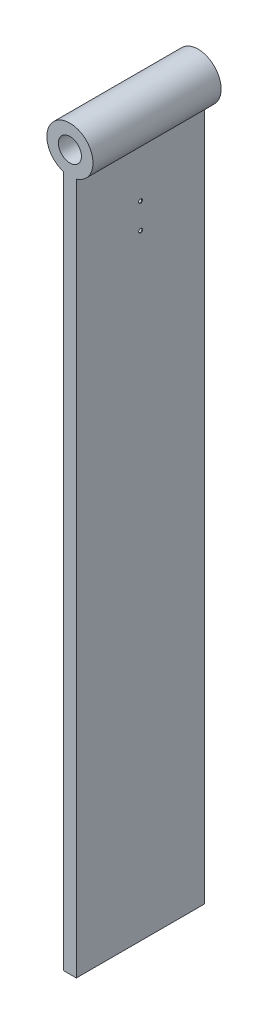
ISO-10303-21;
HEADER;
FILE_DESCRIPTION(('STEP AP214'),'2;1');
FILE_NAME('part.step','',(''),(''),'','','');
FILE_SCHEMA(('AUTOMOTIVE_DESIGN { 1 0 10303 214 1 1 1 1 }'));
ENDSEC;
DATA;
#1=APPLICATION_CONTEXT('core data for automotive mechanical design processes');
#2=APPLICATION_PROTOCOL_DEFINITION('international standard','automotive_design',2000,#1);
#3=PRODUCT_CONTEXT('',#1,'mechanical');
#4=PRODUCT('Part','Part','',(#3));
#5=PRODUCT_RELATED_PRODUCT_CATEGORY('part','',(#4));
#6=PRODUCT_DEFINITION_FORMATION('','',#4);
#7=PRODUCT_DEFINITION_CONTEXT('part definition',#1,'design');
#8=PRODUCT_DEFINITION('design','',#6,#7);
#9=PRODUCT_DEFINITION_SHAPE('','',#8);
#10=(LENGTH_UNIT() NAMED_UNIT(*) SI_UNIT(.MILLI.,.METRE.));
#11=(NAMED_UNIT(*) PLANE_ANGLE_UNIT() SI_UNIT($,.RADIAN.));
#12=(NAMED_UNIT(*) SI_UNIT($,.STERADIAN.) SOLID_ANGLE_UNIT());
#13=UNCERTAINTY_MEASURE_WITH_UNIT(LENGTH_MEASURE(1.E-05),#10,'distance_accuracy_value','');
#14=(GEOMETRIC_REPRESENTATION_CONTEXT(3) GLOBAL_UNCERTAINTY_ASSIGNED_CONTEXT((#13)) GLOBAL_UNIT_ASSIGNED_CONTEXT((#10,
#11,#12)) REPRESENTATION_CONTEXT('',''));
#15=CARTESIAN_POINT('',(0.,0.,0.));
#16=DIRECTION('',(0.,0.,1.));
#17=DIRECTION('',(1.,0.,0.));
#18=AXIS2_PLACEMENT_3D('',#15,#16,#17);
#19=CARTESIAN_POINT('',(0.,0.,100.));
#20=DIRECTION('',(0.,1.,0.));
#21=DIRECTION('',(0.,0.,1.));
#22=AXIS2_PLACEMENT_3D('',#19,#20,#21);
#23=PLANE('',#22);
#24=DIRECTION('',(1.,0.,0.));
#25=VECTOR('',#24,1.);
#26=CARTESIAN_POINT('',(0.,0.,0.));
#27=LINE('',#26,#25);
#28=CARTESIAN_POINT('',(-5.,0.,0.));
#29=VERTEX_POINT('',#28);
#30=CARTESIAN_POINT('',(5.,0.,0.));
#31=VERTEX_POINT('',#30);
#32=EDGE_CURVE('E77',#29,#31,#27,.T.);
#33=ORIENTED_EDGE('',*,*,#32,.T.);
#34=DIRECTION('',(0.,0.,-1.));
#35=VECTOR('',#34,1.);
#36=CARTESIAN_POINT('',(5.,0.,100.));
#37=LINE('',#36,#35);
#38=CARTESIAN_POINT('',(5.,0.,100.));
#39=VERTEX_POINT('',#38);
#40=EDGE_CURVE('E11',#39,#31,#37,.T.);
#41=ORIENTED_EDGE('',*,*,#40,.F.);
#42=DIRECTION('',(1.,0.,0.));
#43=VECTOR('',#42,1.);
#44=CARTESIAN_POINT('',(0.,0.,100.));
#45=LINE('',#44,#43);
#46=CARTESIAN_POINT('',(-5.,0.,100.));
#47=VERTEX_POINT('',#46);
#48=EDGE_CURVE('E82',#47,#39,#45,.T.);
#49=ORIENTED_EDGE('',*,*,#48,.F.);
#50=DIRECTION('',(0.,0.,-1.));
#51=VECTOR('',#50,1.);
#52=CARTESIAN_POINT('',(-5.,0.,100.));
#53=LINE('',#52,#51);
#54=EDGE_CURVE('E98',#47,#29,#53,.T.);
#55=ORIENTED_EDGE('',*,*,#54,.T.);
#56=EDGE_LOOP('',(#33,#41,#49,#55));
#57=FACE_BOUND('',#56,.T.);
#58=ADVANCED_FACE('F35',(#57),#23,.F.);
#59=CARTESIAN_POINT('',(5.,0.,100.));
#60=DIRECTION('',(-1.,0.,0.));
#61=DIRECTION('',(0.,0.,1.));
#62=AXIS2_PLACEMENT_3D('',#59,#60,#61);
#63=PLANE('',#62);
#64=CARTESIAN_POINT('',(5.,480.,49.8902821263165));
#65=DIRECTION('',(1.,0.,0.));
#66=DIRECTION('',(0.,0.,-1.));
#67=AXIS2_PLACEMENT_3D('',#64,#65,#66);
#68=CIRCLE('',#67,1.525);
#69=CARTESIAN_POINT('',(5.,480.,48.3652821263165));
#70=VERTEX_POINT('',#69);
#71=EDGE_CURVE('E163',#70,#70,#68,.T.);
#72=ORIENTED_EDGE('',*,*,#71,.F.);
#73=EDGE_LOOP('',(#72));
#74=FACE_BOUND('',#73,.T.);
#75=CARTESIAN_POINT('',(5.,500.,49.9389055545462));
#76=DIRECTION('',(1.,0.,0.));
#77=DIRECTION('',(0.,0.,-1.));
#78=AXIS2_PLACEMENT_3D('',#75,#76,#77);
#79=CIRCLE('',#78,1.525);
#80=CARTESIAN_POINT('',(5.,500.,48.4139055545462));
#81=VERTEX_POINT('',#80);
#82=EDGE_CURVE('E119',#81,#81,#79,.T.);
#83=ORIENTED_EDGE('',*,*,#82,.F.);
#84=EDGE_LOOP('',(#83));
#85=FACE_BOUND('',#84,.T.);
#86=DIRECTION('',(0.,1.,0.));
#87=VECTOR('',#86,1.);
#88=CARTESIAN_POINT('',(5.,0.,0.));
#89=LINE('',#88,#87);
#90=CARTESIAN_POINT('',(5.,540.,0.));
#91=VERTEX_POINT('',#90);
#92=EDGE_CURVE('E93',#31,#91,#89,.T.);
#93=ORIENTED_EDGE('',*,*,#92,.T.);
#94=DIRECTION('',(0.,0.,-1.));
#95=VECTOR('',#94,1.);
#96=CARTESIAN_POINT('',(5.,540.,100.));
#97=LINE('',#96,#95);
#98=CARTESIAN_POINT('',(5.,540.,100.));
#99=VERTEX_POINT('',#98);
#100=EDGE_CURVE('E44',#99,#91,#97,.T.);
#101=ORIENTED_EDGE('',*,*,#100,.F.);
#102=DIRECTION('',(0.,1.,0.));
#103=VECTOR('',#102,1.);
#104=CARTESIAN_POINT('',(5.,0.,100.));
#105=LINE('',#104,#103);
#106=EDGE_CURVE('E85',#39,#99,#105,.T.);
#107=ORIENTED_EDGE('',*,*,#106,.F.);
#108=ORIENTED_EDGE('',*,*,#40,.T.);
#109=EDGE_LOOP('',(#93,#101,#107,#108));
#110=FACE_BOUND('',#109,.T.);
#111=ADVANCED_FACE('F92',(#74,#85,#110),#63,.F.);
#112=CARTESIAN_POINT('',(0.,557.291616465791,100.));
#113=DIRECTION('',(0.,0.,-1.));
#114=DIRECTION('',(-1.,0.,0.));
#115=AXIS2_PLACEMENT_3D('',#112,#113,#114);
#116=CYLINDRICAL_SURFACE('',#115,18.);
#117=CARTESIAN_POINT('',(0.,557.291616465791,0.));
#118=DIRECTION('',(0.,0.,1.));
#119=DIRECTION('',(1.,0.,0.));
#120=AXIS2_PLACEMENT_3D('',#117,#118,#119);
#121=CIRCLE('',#120,18.);
#122=CARTESIAN_POINT('',(-4.99999999999998,540.,0.));
#123=VERTEX_POINT('',#122);
#124=EDGE_CURVE('E70',#91,#123,#121,.T.);
#125=ORIENTED_EDGE('',*,*,#124,.T.);
#126=DIRECTION('',(0.,0.,-1.));
#127=VECTOR('',#126,1.);
#128=CARTESIAN_POINT('',(-4.99999999999998,540.,100.));
#129=LINE('',#128,#127);
#130=CARTESIAN_POINT('',(-4.99999999999998,540.,100.));
#131=VERTEX_POINT('',#130);
#132=EDGE_CURVE('E94',#131,#123,#129,.T.);
#133=ORIENTED_EDGE('',*,*,#132,.F.);
#134=CARTESIAN_POINT('',(0.,557.291616465791,100.));
#135=DIRECTION('',(0.,0.,1.));
#136=DIRECTION('',(1.,0.,0.));
#137=AXIS2_PLACEMENT_3D('',#134,#135,#136);
#138=CIRCLE('',#137,18.);
#139=EDGE_CURVE('E89',#99,#131,#138,.T.);
#140=ORIENTED_EDGE('',*,*,#139,.F.);
#141=ORIENTED_EDGE('',*,*,#100,.T.);
#142=EDGE_LOOP('',(#125,#133,#140,#141));
#143=FACE_BOUND('',#142,.T.);
#144=ADVANCED_FACE('F96',(#143),#116,.T.);
#145=CARTESIAN_POINT('',(-5.,0.,100.));
#146=DIRECTION('',(1.,0.,0.));
#147=DIRECTION('',(0.,0.,-1.));
#148=AXIS2_PLACEMENT_3D('',#145,#146,#147);
#149=PLANE('',#148);
#150=CARTESIAN_POINT('',(-5.,480.,49.8902821263165));
#151=DIRECTION('',(1.,0.,0.));
#152=DIRECTION('',(0.,0.,-1.));
#153=AXIS2_PLACEMENT_3D('',#150,#151,#152);
#154=CIRCLE('',#153,1.24999999999997);
#155=CARTESIAN_POINT('',(-5.,480.,48.6402821263165));
#156=VERTEX_POINT('',#155);
#157=EDGE_CURVE('E38',#156,#156,#154,.T.);
#158=ORIENTED_EDGE('',*,*,#157,.T.);
#159=EDGE_LOOP('',(#158));
#160=FACE_BOUND('',#159,.T.);
#161=CARTESIAN_POINT('',(-5.,500.,49.9389055545462));
#162=DIRECTION('',(1.,0.,0.));
#163=DIRECTION('',(0.,0.,-1.));
#164=AXIS2_PLACEMENT_3D('',#161,#162,#163);
#165=CIRCLE('',#164,1.24999999999997);
#166=CARTESIAN_POINT('',(-5.,500.,48.6889055545462));
#167=VERTEX_POINT('',#166);
#168=EDGE_CURVE('E110',#167,#167,#165,.T.);
#169=ORIENTED_EDGE('',*,*,#168,.T.);
#170=EDGE_LOOP('',(#169));
#171=FACE_BOUND('',#170,.T.);
#172=DIRECTION('',(0.,-1.,0.));
#173=VECTOR('',#172,1.);
#174=CARTESIAN_POINT('',(-5.,0.,0.));
#175=LINE('',#174,#173);
#176=EDGE_CURVE('E106',#123,#29,#175,.T.);
#177=ORIENTED_EDGE('',*,*,#176,.T.);
#178=ORIENTED_EDGE('',*,*,#54,.F.);
#179=DIRECTION('',(0.,-1.,0.));
#180=VECTOR('',#179,1.);
#181=CARTESIAN_POINT('',(-5.,0.,100.));
#182=LINE('',#181,#180);
#183=EDGE_CURVE('E53',#131,#47,#182,.T.);
#184=ORIENTED_EDGE('',*,*,#183,.F.);
#185=ORIENTED_EDGE('',*,*,#132,.T.);
#186=EDGE_LOOP('',(#177,#178,#184,#185));
#187=FACE_BOUND('',#186,.T.);
#188=ADVANCED_FACE('F140',(#160,#171,#187),#149,.F.);
#189=CARTESIAN_POINT('',(0.,557.291616465791,100.));
#190=DIRECTION('',(0.,0.,1.));
#191=DIRECTION('',(1.,0.,0.));
#192=AXIS2_PLACEMENT_3D('',#189,#190,#191);
#193=PLANE('',#192);
#194=CARTESIAN_POINT('',(0.,557.291616465791,100.));
#195=DIRECTION('',(0.,0.,1.));
#196=DIRECTION('',(1.,0.,0.));
#197=AXIS2_PLACEMENT_3D('',#194,#195,#196);
#198=CIRCLE('',#197,9.);
#199=CARTESIAN_POINT('',(9.,557.291616465791,100.));
#200=VERTEX_POINT('',#199);
#201=EDGE_CURVE('E112',#200,#200,#198,.T.);
#202=ORIENTED_EDGE('',*,*,#201,.F.);
#203=EDGE_LOOP('',(#202));
#204=FACE_BOUND('',#203,.T.);
#205=ORIENTED_EDGE('',*,*,#48,.T.);
#206=ORIENTED_EDGE('',*,*,#106,.T.);
#207=ORIENTED_EDGE('',*,*,#139,.T.);
#208=ORIENTED_EDGE('',*,*,#183,.T.);
#209=EDGE_LOOP('',(#205,#206,#207,#208));
#210=FACE_BOUND('',#209,.T.);
#211=ADVANCED_FACE('F87',(#204,#210),#193,.T.);
#212=CARTESIAN_POINT('',(0.,557.291616465791,0.));
#213=DIRECTION('',(0.,0.,1.));
#214=DIRECTION('',(1.,0.,0.));
#215=AXIS2_PLACEMENT_3D('',#212,#213,#214);
#216=PLANE('',#215);
#217=CARTESIAN_POINT('',(0.,557.291616465791,0.));
#218=DIRECTION('',(0.,0.,1.));
#219=DIRECTION('',(1.,0.,0.));
#220=AXIS2_PLACEMENT_3D('',#217,#218,#219);
#221=CIRCLE('',#220,9.);
#222=CARTESIAN_POINT('',(9.,557.291616465791,0.));
#223=VERTEX_POINT('',#222);
#224=EDGE_CURVE('E103',#223,#223,#221,.T.);
#225=ORIENTED_EDGE('',*,*,#224,.T.);
#226=EDGE_LOOP('',(#225));
#227=FACE_BOUND('',#226,.T.);
#228=ORIENTED_EDGE('',*,*,#32,.F.);
#229=ORIENTED_EDGE('',*,*,#176,.F.);
#230=ORIENTED_EDGE('',*,*,#124,.F.);
#231=ORIENTED_EDGE('',*,*,#92,.F.);
#232=EDGE_LOOP('',(#228,#229,#230,#231));
#233=FACE_BOUND('',#232,.T.);
#234=ADVANCED_FACE('F130',(#227,#233),#216,.F.);
#235=CARTESIAN_POINT('',(0.,557.291616465791,0.));
#236=DIRECTION('',(0.,0.,1.));
#237=DIRECTION('',(1.,0.,0.));
#238=AXIS2_PLACEMENT_3D('',#235,#236,#237);
#239=CYLINDRICAL_SURFACE('',#238,9.);
#240=ORIENTED_EDGE('',*,*,#224,.F.);
#241=EDGE_LOOP('',(#240));
#242=FACE_BOUND('',#241,.T.);
#243=ORIENTED_EDGE('',*,*,#201,.T.);
#244=EDGE_LOOP('',(#243));
#245=FACE_BOUND('',#244,.T.);
#246=ADVANCED_FACE('F132',(#242,#245),#239,.F.);
#247=CARTESIAN_POINT('',(5.,500.,49.9389055545462));
#248=DIRECTION('',(1.,0.,0.));
#249=DIRECTION('',(0.,0.,-1.));
#250=AXIS2_PLACEMENT_3D('',#247,#248,#249);
#251=CYLINDRICAL_SURFACE('',#250,1.24999999999997);
#252=CARTESIAN_POINT('',(4.72499999999999,500.,49.9389055545462));
#253=DIRECTION('',(1.,0.,0.));
#254=DIRECTION('',(0.,0.,-1.));
#255=AXIS2_PLACEMENT_3D('',#252,#253,#254);
#256=CIRCLE('',#255,1.24999999999997);
#257=CARTESIAN_POINT('',(4.72499999999999,500.,48.6889055545462));
#258=VERTEX_POINT('',#257);
#259=EDGE_CURVE('E113',#258,#258,#256,.T.);
#260=ORIENTED_EDGE('',*,*,#259,.T.);
#261=EDGE_LOOP('',(#260));
#262=FACE_BOUND('',#261,.T.);
#263=ORIENTED_EDGE('',*,*,#168,.F.);
#264=EDGE_LOOP('',(#263));
#265=FACE_BOUND('',#264,.T.);
#266=ADVANCED_FACE('F135',(#262,#265),#251,.F.);
#267=CARTESIAN_POINT('',(5.,500.,49.9389055545462));
#268=DIRECTION('',(1.,0.,0.));
#269=DIRECTION('',(0.,0.,-1.));
#270=AXIS2_PLACEMENT_3D('',#267,#268,#269);
#271=CONICAL_SURFACE('',#270,1.525,0.78539816339747);
#272=ORIENTED_EDGE('',*,*,#259,.F.);
#273=EDGE_LOOP('',(#272));
#274=FACE_BOUND('',#273,.T.);
#275=ORIENTED_EDGE('',*,*,#82,.T.);
#276=EDGE_LOOP('',(#275));
#277=FACE_BOUND('',#276,.T.);
#278=ADVANCED_FACE('F166',(#274,#277),#271,.F.);
#279=CARTESIAN_POINT('',(5.,480.,49.8902821263165));
#280=DIRECTION('',(1.,0.,0.));
#281=DIRECTION('',(0.,0.,-1.));
#282=AXIS2_PLACEMENT_3D('',#279,#280,#281);
#283=CYLINDRICAL_SURFACE('',#282,1.24999999999997);
#284=CARTESIAN_POINT('',(4.72499999999999,480.,49.8902821263165));
#285=DIRECTION('',(1.,0.,0.));
#286=DIRECTION('',(0.,0.,-1.));
#287=AXIS2_PLACEMENT_3D('',#284,#285,#286);
#288=CIRCLE('',#287,1.24999999999997);
#289=CARTESIAN_POINT('',(4.72499999999999,480.,48.6402821263165));
#290=VERTEX_POINT('',#289);
#291=EDGE_CURVE('E187',#290,#290,#288,.T.);
#292=ORIENTED_EDGE('',*,*,#291,.T.);
#293=EDGE_LOOP('',(#292));
#294=FACE_BOUND('',#293,.T.);
#295=ORIENTED_EDGE('',*,*,#157,.F.);
#296=EDGE_LOOP('',(#295));
#297=FACE_BOUND('',#296,.T.);
#298=ADVANCED_FACE('F168',(#294,#297),#283,.F.);
#299=CARTESIAN_POINT('',(5.,480.,49.8902821263165));
#300=DIRECTION('',(1.,0.,0.));
#301=DIRECTION('',(0.,0.,-1.));
#302=AXIS2_PLACEMENT_3D('',#299,#300,#301);
#303=CONICAL_SURFACE('',#302,1.525,0.78539816339747);
#304=ORIENTED_EDGE('',*,*,#291,.F.);
#305=EDGE_LOOP('',(#304));
#306=FACE_BOUND('',#305,.T.);
#307=ORIENTED_EDGE('',*,*,#71,.T.);
#308=EDGE_LOOP('',(#307));
#309=FACE_BOUND('',#308,.T.);
#310=ADVANCED_FACE('F175',(#306,#309),#303,.F.);
#311=CLOSED_SHELL('',(#58,#111,#144,#188,#211,#234,#246,#266,#278,#298,#310));
#312=MANIFOLD_SOLID_BREP('B2',#311);
#313=ADVANCED_BREP_SHAPE_REPRESENTATION('',(#18,#312),#14);
#314=SHAPE_DEFINITION_REPRESENTATION(#9,#313);
ENDSEC;
END-ISO-10303-21;
